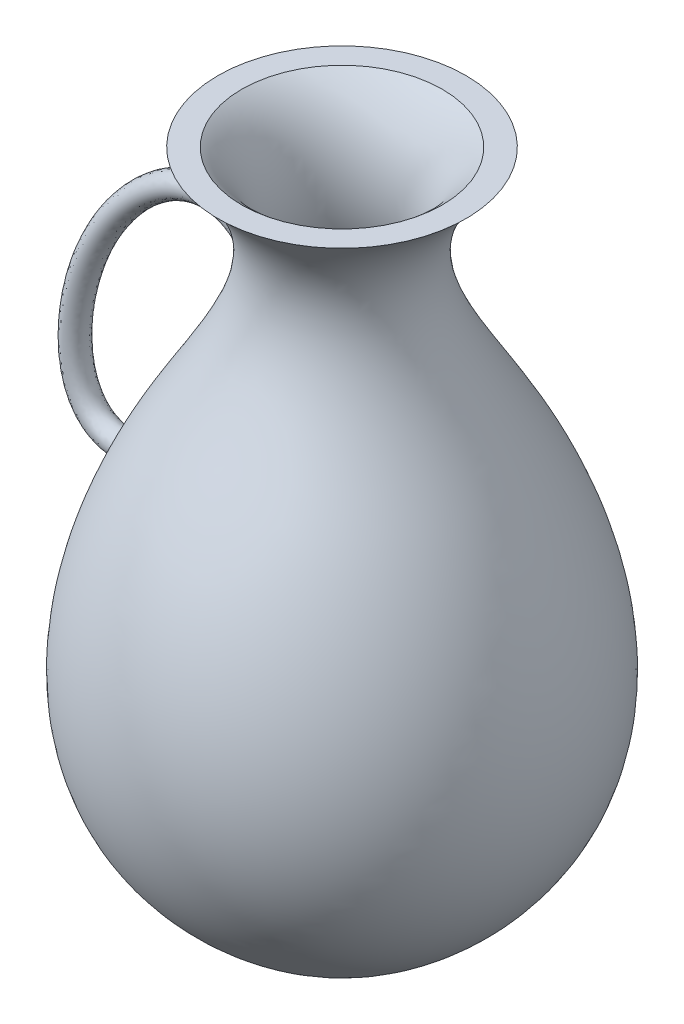
ISO-10303-21;
HEADER;
FILE_DESCRIPTION(('STEP AP214'),'2;1');
FILE_NAME('part.step','',(''),(''),'','','');
FILE_SCHEMA(('AUTOMOTIVE_DESIGN { 1 0 10303 214 1 1 1 1 }'));
ENDSEC;
DATA;
#1=APPLICATION_CONTEXT('core data for automotive mechanical design processes');
#2=APPLICATION_PROTOCOL_DEFINITION('international standard','automotive_design',2000,#1);
#3=PRODUCT_CONTEXT('',#1,'mechanical');
#4=PRODUCT('Part','Part','',(#3));
#5=PRODUCT_RELATED_PRODUCT_CATEGORY('part','',(#4));
#6=PRODUCT_DEFINITION_FORMATION('','',#4);
#7=PRODUCT_DEFINITION_CONTEXT('part definition',#1,'design');
#8=PRODUCT_DEFINITION('design','',#6,#7);
#9=PRODUCT_DEFINITION_SHAPE('','',#8);
#10=(LENGTH_UNIT() NAMED_UNIT(*) SI_UNIT(.MILLI.,.METRE.));
#11=(NAMED_UNIT(*) PLANE_ANGLE_UNIT() SI_UNIT($,.RADIAN.));
#12=(NAMED_UNIT(*) SI_UNIT($,.STERADIAN.) SOLID_ANGLE_UNIT());
#13=UNCERTAINTY_MEASURE_WITH_UNIT(LENGTH_MEASURE(1.E-05),#10,'distance_accuracy_value','');
#14=(GEOMETRIC_REPRESENTATION_CONTEXT(3) GLOBAL_UNCERTAINTY_ASSIGNED_CONTEXT((#13)) GLOBAL_UNIT_ASSIGNED_CONTEXT((#10,
#11,#12)) REPRESENTATION_CONTEXT('',''));
#15=CARTESIAN_POINT('',(0.,0.,0.));
#16=DIRECTION('',(0.,0.,1.));
#17=DIRECTION('',(1.,0.,0.));
#18=AXIS2_PLACEMENT_3D('',#15,#16,#17);
#19=CARTESIAN_POINT('',(-23.9769236165807,44.5809399823382,0.));
#20=CARTESIAN_POINT('',(-5.42195315277621,28.4200955873217,0.));
#21=CARTESIAN_POINT('',(-46.0242510550906,-16.2187224078489,0.));
#22=CARTESIAN_POINT('',(-48.5199059719437,-74.6494313286918,0.));
#23=CARTESIAN_POINT('',(0.,-89.5207910663203,0.));
#24=B_SPLINE_CURVE_WITH_KNOTS('',3,(#19,#20,#21,#22,#23),.UNSPECIFIED.,.F.,.F.,(4,1,4),(0.,
0.339764154874091,1.),.UNSPECIFIED.);
#25=CARTESIAN_POINT('',(0.,-89.5207910663203,0.));
#26=DIRECTION('',(0.,-1.,0.));
#27=AXIS1_PLACEMENT('',#25,#26);
#28=SURFACE_OF_REVOLUTION('',#24,#27);
#29=CARTESIAN_POINT('',(-15.4846586482681,21.9881871161997,0.));
#30=CARTESIAN_POINT('',(-15.4846586310552,21.9881875024989,-0.0566308280452177));
#31=CARTESIAN_POINT('',(-15.4849672611172,21.9856475511458,-0.113260997854693));
#32=CARTESIAN_POINT('',(-15.4862046613587,21.9755390671561,-0.226055823023642));
#33=CARTESIAN_POINT('',(-15.4871333657724,21.9679710677999,-0.282220527111403));
#34=CARTESIAN_POINT('',(-15.4896201849565,21.9479452229395,-0.39366319777845));
#35=CARTESIAN_POINT('',(-15.491178367651,21.9354868497412,-0.448941067994016));
#36=CARTESIAN_POINT('',(-15.4949386130992,21.9059022086931,-0.558228113817855));
#37=CARTESIAN_POINT('',(-15.4971410383539,21.888773313214,-0.612236556613374));
#38=CARTESIAN_POINT('',(-15.5047140507907,21.8310077349153,-0.771195631375085));
#39=CARTESIAN_POINT('',(-15.5110656735246,21.7838588507491,-0.873793701972682));
#40=CARTESIAN_POINT('',(-15.5265773878386,21.6747330723559,-1.07054544744039));
#41=CARTESIAN_POINT('',(-15.5357402116098,21.6127417657875,-1.16469079157891));
#42=CARTESIAN_POINT('',(-15.5522442812345,21.5074288328944,-1.30292741598176));
#43=CARTESIAN_POINT('',(-15.5585399010819,21.4683161054983,-1.35042524865876));
#44=CARTESIAN_POINT('',(-15.5720579808302,21.3868953149317,-1.44236664276826));
#45=CARTESIAN_POINT('',(-15.5792794632435,21.3445906407976,-1.486813350536));
#46=CARTESIAN_POINT('',(-15.602400181645,21.213336537084,-1.61558369809159));
#47=CARTESIAN_POINT('',(-15.6197515456031,21.1200743068922,-1.69530234497984));
#48=CARTESIAN_POINT('',(-15.6623211085149,20.9056578277834,-1.8563612730904));
#49=CARTESIAN_POINT('',(-15.6884148487752,20.7826212365171,-1.93495101338094));
#50=CARTESIAN_POINT('',(-15.7466278575065,20.5277558219982,-2.0734914048249));
#51=CARTESIAN_POINT('',(-15.7787514538054,20.3959207278413,-2.13342858577783));
#52=CARTESIAN_POINT('',(-15.8543332905705,20.1063058610454,-2.24173116171623));
#53=CARTESIAN_POINT('',(-15.8987701585459,19.9476105926655,-2.28699078163682));
#54=CARTESIAN_POINT('',(-15.9951714069707,19.6271264926429,-2.3510527353061));
#55=CARTESIAN_POINT('',(-16.047138809496,19.465336441768,-2.36984441460604));
#56=CARTESIAN_POINT('',(-16.1594119955139,19.137333527332,-2.37976474996521));
#57=CARTESIAN_POINT('',(-16.2199467459662,18.9711652155641,-2.36989733966085));
#58=CARTESIAN_POINT('',(-16.3456121399884,18.6454561785574,-2.31881688881493));
#59=CARTESIAN_POINT('',(-16.4107407096036,18.4859125135467,-2.27761791228017));
#60=CARTESIAN_POINT('',(-16.5372387225333,18.1907388012068,-2.16737118644814));
#61=CARTESIAN_POINT('',(-16.598524473127,18.0542126658153,-2.10063975237111));
#62=CARTESIAN_POINT('',(-16.7184869401965,17.7967847275552,-1.94013276263575));
#63=CARTESIAN_POINT('',(-16.7771658522437,17.6758696063833,-1.84638048313262));
#64=CARTESIAN_POINT('',(-16.8815534502158,17.467012939596,-1.64597061656276));
#65=CARTESIAN_POINT('',(-16.9279786140545,17.3768917722089,-1.5419539476044));
#66=CARTESIAN_POINT('',(-17.0126065031513,17.2158577137798,-1.31706256212995));
#67=CARTESIAN_POINT('',(-17.0508136375267,17.1449345173824,-1.19619694303089));
#68=CARTESIAN_POINT('',(-17.1136960510831,17.0297751263797,-0.952121002301007));
#69=CARTESIAN_POINT('',(-17.1392341074897,16.9838066034065,-0.829946830536704));
#70=CARTESIAN_POINT('',(-17.1797511414962,16.9113908884151,-0.578282406850921));
#71=CARTESIAN_POINT('',(-17.1947328208396,16.8849387014069,-0.448794036057802));
#72=CARTESIAN_POINT('',(-17.2128885581464,16.8529365170228,-0.191578972930642));
#73=CARTESIAN_POINT('',(-17.2164967257469,16.8466179434769,-0.0639777212258459));
#74=CARTESIAN_POINT('',(-17.2129381525049,16.8528697303324,0.190603690280205));
#75=CARTESIAN_POINT('',(-17.2057725099638,16.8654381653584,0.317583912066517));
#76=CARTESIAN_POINT('',(-17.1811809750066,16.9089276326889,0.56609121625103));
#77=CARTESIAN_POINT('',(-17.163851544402,16.9396761446286,0.687658155547459));
#78=CARTESIAN_POINT('',(-17.119949926502,17.0185779555019,0.92322420627447));
#79=CARTESIAN_POINT('',(-17.0933778598061,17.0667310273381,1.03722341642692));
#80=CARTESIAN_POINT('',(-17.0320745599174,17.179767536135,1.25582797109556));
#81=CARTESIAN_POINT('',(-16.9972592201795,17.2448241558124,1.3603199899664));
#82=CARTESIAN_POINT('',(-16.9214440664285,17.3896421194946,1.55599624889569));
#83=CARTESIAN_POINT('',(-16.8804435689232,17.4694050888444,1.64717901601871));
#84=CARTESIAN_POINT('',(-16.7926641583825,17.6447024491478,1.81748171967185));
#85=CARTESIAN_POINT('',(-16.7457277508725,17.7407105501863,1.8960317153966));
#86=CARTESIAN_POINT('',(-16.649574432133,17.9436674679995,2.03560357370403));
#87=CARTESIAN_POINT('',(-16.6003569055191,18.0506192465927,2.09662067404329));
#88=CARTESIAN_POINT('',(-16.4980963930875,18.2808467945798,2.20438218944362));
#89=CARTESIAN_POINT('',(-16.445033809258,18.4047436435224,2.24977778365198));
#90=CARTESIAN_POINT('',(-16.3406785653287,18.6589307397837,2.31996332648055));
#91=CARTESIAN_POINT('',(-16.2893866453892,18.7892236068976,2.34474475573452));
#92=CARTESIAN_POINT('',(-16.1851250555281,19.0666652448371,2.37576887395004));
#93=CARTESIAN_POINT('',(-16.1325108474612,19.2141855044415,2.37988178822115));
#94=CARTESIAN_POINT('',(-16.0327758802893,19.5098876163368,2.36486199329155));
#95=CARTESIAN_POINT('',(-15.9856573867994,19.6580697155176,2.34571973398011));
#96=CARTESIAN_POINT('',(-15.8934921143531,19.9660000711099,2.28226670567207));
#97=CARTESIAN_POINT('',(-15.8490876304141,20.1254790603436,2.23569852959258));
#98=CARTESIAN_POINT('',(-15.7683337162789,20.4368955593259,2.11681243104902));
#99=CARTESIAN_POINT('',(-15.7319923211072,20.5888254303001,2.04446900841204));
#100=CARTESIAN_POINT('',(-15.6664304468764,20.8842414562867,1.87229357219351));
#101=CARTESIAN_POINT('',(-15.6374475785367,21.0273539586041,1.77172386531045));
#102=CARTESIAN_POINT('',(-15.5876347962741,21.2931583355737,1.54490088277879));
#103=CARTESIAN_POINT('',(-15.5667877371376,21.4158928370648,1.41870247971863));
#104=CARTESIAN_POINT('',(-15.5378251492661,21.5987471947336,1.18543110372288));
#105=CARTESIAN_POINT('',(-15.5277662138425,21.6664852615925,1.08454612887964));
#106=CARTESIAN_POINT('',(-15.5109183262407,21.7847863737424,0.872936447875485));
#107=CARTESIAN_POINT('',(-15.5041251846823,21.8353713983684,0.762224564996117));
#108=CARTESIAN_POINT('',(-15.4940622447935,21.9123955949627,0.543993618011293));
#109=CARTESIAN_POINT('',(-15.4905235676073,21.9406425723435,0.437134874888648));
#110=CARTESIAN_POINT('',(-15.4869980884764,21.9690756545416,0.274463539073463));
#111=CARTESIAN_POINT('',(-15.4861200244254,21.9762305249835,0.21981896050355));
#112=CARTESIAN_POINT('',(-15.4849504191475,21.9857852049477,0.110115942211978));
#113=CARTESIAN_POINT('',(-15.4846586650029,21.9881867406317,0.0550576600195059));
#114=CARTESIAN_POINT('',(-15.4846586482681,21.9881871161997,0.));
#115=B_SPLINE_CURVE_WITH_KNOTS('',3,(#29,#30,#31,#32,#33,#34,#35,#36,#37,#38,#39,#40,#41,#42,
#43,#44,#45,#46,#47,#48,#49,#50,#51,#52,#53,#54,#55,#56,#57,#58,#59,#60,#61,#62,#63,#64,#65,#66,
#67,#68,#69,#70,#71,#72,#73,#74,#75,#76,#77,#78,#79,#80,#81,#82,#83,#84,#85,#86,#87,#88,#89,#90,
#91,#92,#93,#94,#95,#96,#97,#98,#99,#100,#101,#102,#103,#104,#105,#106,#107,#108,#109,#110,#111,
#112,#113,#114),.UNSPECIFIED.,.T.,.F.,(4,2,2,2,2,2,2,2,2,2,2,2,2,2,2,2,2,2,2,2,2,2,2,2,2,2,2,2,
2,2,2,2,2,2,2,2,2,2,2,2,2,2,4),(0.,0.169833803772745,0.3396495976529,0.509483720485779,
0.679413589613035,1.01712267816399,1.35516102969569,1.54056426368787,1.72577334405214,
2.09632448642307,2.53957752453702,2.98314992502883,3.49357922503822,4.00421393544017,
4.53280615113746,5.06116123410674,5.54995315274622,6.03832527084979,6.47171935399056,
6.90488033035395,7.30191734409671,7.69885270533125,8.08044185419732,8.46199210582153,
8.83997845863488,9.21795987960476,9.59997801870668,9.98203840376801,10.3782103751785,
10.7744898523811,11.1993851813726,11.6244560228351,12.0925414465416,12.5608191620463,
13.0744362605198,13.5885629122072,14.1176293708063,14.6455747875883,15.0099534783168,
15.3738634862652,15.7039360119797,15.8691119360109,16.0342278658093),.UNSPECIFIED.);
#116=CARTESIAN_POINT('',(-15.4846586482681,21.9881871161997,0.));
#117=VERTEX_POINT('',#116);
#118=EDGE_CURVE('E74',#117,#117,#115,.T.);
#119=ORIENTED_EDGE('',*,*,#118,.F.);
#120=EDGE_LOOP('',(#119));
#121=FACE_BOUND('',#120,.T.);
#122=CARTESIAN_POINT('',(0.,44.5809399823382,0.));
#123=DIRECTION('',(0.,-1.,0.));
#124=DIRECTION('',(0.,0.,-1.));
#125=AXIS2_PLACEMENT_3D('',#122,#123,#124);
#126=CIRCLE('',#125,23.9769236165807);
#127=CARTESIAN_POINT('',(0.,44.5809399823382,-23.9769236165807));
#128=VERTEX_POINT('',#127);
#129=EDGE_CURVE('E77',#128,#128,#126,.T.);
#130=ORIENTED_EDGE('',*,*,#129,.T.);
#131=EDGE_LOOP('',(#130));
#132=FACE_BOUND('',#131,.T.);
#133=CARTESIAN_POINT('',(0.,-89.5207910663203,0.));
#134=VERTEX_POINT('',#133);
#135=VERTEX_LOOP('',#134);
#136=FACE_BOUND('',#135,.T.);
#137=CARTESIAN_POINT('',(-37.2899792134387,-23.7287343852869,2.40450873457841));
#138=CARTESIAN_POINT('',(-37.3267072141203,-23.6793700726973,1.60300582305227));
#139=CARTESIAN_POINT('',(-37.3450712144611,-23.6546879164025,0.801502911526137));
#140=CARTESIAN_POINT('',(-37.3450712144611,-23.6546879164025,-0.801502911526134));
#141=CARTESIAN_POINT('',(-37.3267072141203,-23.6793700726973,-1.60300582305227));
#142=CARTESIAN_POINT('',(-37.2899792134387,-23.7287343852869,-2.4045087345784));
#143=B_SPLINE_CURVE_WITH_KNOTS('',3,(#137,#138,#139,#140,#141,#142),.UNSPECIFIED.,.F.,.F.,(4,2,
4),(0.,2.40627934014211,4.81255868028423),.UNSPECIFIED.);
#144=CARTESIAN_POINT('',(-37.324553449318,-23.6822648428175,1.46781991482423));
#145=VERTEX_POINT('',#144);
#146=CARTESIAN_POINT('',(-37.324553449318,-23.6822648428175,-1.46781991482425));
#147=VERTEX_POINT('',#146);
#148=EDGE_CURVE('E11',#145,#147,#143,.T.);
#149=ORIENTED_EDGE('',*,*,#148,.F.);
#150=CARTESIAN_POINT('',(-37.324553449318,-23.6822648428175,-1.46781991482425));
#151=CARTESIAN_POINT('',(-37.3368074573239,-23.7300693915853,-1.52357790230743));
#152=CARTESIAN_POINT('',(-37.3497103674309,-23.7802842589039,-1.57705726482879));
#153=CARTESIAN_POINT('',(-37.3766995131034,-23.8850179480785,-1.67923043926734));
#154=CARTESIAN_POINT('',(-37.3907850303667,-23.9395341561538,-1.72792711768295));
#155=CARTESIAN_POINT('',(-37.4345436284967,-24.1083743388203,-1.86620681581523));
#156=CARTESIAN_POINT('',(-37.4658242292105,-24.2284025102152,-1.94845417733407));
#157=CARTESIAN_POINT('',(-37.5316336341045,-24.4791867318706,-2.09174475142458));
#158=CARTESIAN_POINT('',(-37.5661554173511,-24.6099195190011,-2.15283251108086));
#159=CARTESIAN_POINT('',(-37.6376995655826,-24.8789199094511,-2.25345528416354));
#160=CARTESIAN_POINT('',(-37.674724413007,-25.017194965848,-2.29296853773085));
#161=CARTESIAN_POINT('',(-37.7534665065004,-25.3091364373777,-2.35216875340774));
#162=CARTESIAN_POINT('',(-37.7953212833789,-25.4631443025396,-2.36999795898259));
#163=CARTESIAN_POINT('',(-37.8798461832126,-25.7717544933278,-2.37944400714323));
#164=CARTESIAN_POINT('',(-37.9225164232186,-25.9263569017113,-2.37105705816984));
#165=CARTESIAN_POINT('',(-38.0086930799105,-26.2362779746183,-2.32731082081028));
#166=CARTESIAN_POINT('',(-38.052189402669,-26.3914952130642,-2.29120197196735));
#167=CARTESIAN_POINT('',(-38.1373764048592,-26.693341871101,-2.19130733680301));
#168=CARTESIAN_POINT('',(-38.1790672459042,-26.8399720597574,-2.12752403335114));
#169=CARTESIAN_POINT('',(-38.2574001147454,-27.1137491737671,-1.97627271113693));
#170=CARTESIAN_POINT('',(-38.2941787068955,-27.2414468066039,-1.889876731829));
#171=CARTESIAN_POINT('',(-38.3630125132435,-27.4792216137396,-1.69398253942996));
#172=CARTESIAN_POINT('',(-38.3950705495669,-27.58930931934,-1.58449822542107));
#173=CARTESIAN_POINT('',(-38.4502628618685,-27.7780818171513,-1.35589862416585));
#174=CARTESIAN_POINT('',(-38.4739366506348,-27.8586866379785,-1.23850077113203));
#175=CARTESIAN_POINT('',(-38.5148152917476,-27.997504912286,-0.990120580921116));
#176=CARTESIAN_POINT('',(-38.5320246760738,-28.0557340532744,-0.859147843146157));
#177=CARTESIAN_POINT('',(-38.557750531908,-28.1426495243621,-0.60061617752544));
#178=CARTESIAN_POINT('',(-38.5669273969265,-28.173582426155,-0.473875590983884));
#179=CARTESIAN_POINT('',(-38.5787045983607,-28.2132649948178,-0.216680733669161));
#180=CARTESIAN_POINT('',(-38.581307562565,-28.2220235254634,-0.0862279678615391));
#181=CARTESIAN_POINT('',(-38.5798475604531,-28.2171075582975,0.166914652490979));
#182=CARTESIAN_POINT('',(-38.5761475409685,-28.2046544988519,0.289632459036865));
#183=CARTESIAN_POINT('',(-38.5629449398844,-28.1601551208917,0.531122215167683));
#184=CARTESIAN_POINT('',(-38.5534427354924,-28.1281100760771,0.649894420731989));
#185=CARTESIAN_POINT('',(-38.5290613355951,-28.0457017476329,0.880318754068467));
#186=CARTESIAN_POINT('',(-38.5141807829853,-27.9953338406225,0.991969076421617));
#187=CARTESIAN_POINT('',(-38.4796627703841,-27.878145801705,1.20544463231601));
#188=CARTESIAN_POINT('',(-38.4600244788797,-27.8113227938959,1.3072681440647));
#189=CARTESIAN_POINT('',(-38.4156181343548,-27.6596659411153,1.50387362278354));
#190=CARTESIAN_POINT('',(-38.3906398032858,-27.5740882831112,1.59803307905693));
#191=CARTESIAN_POINT('',(-38.3371359088114,-27.3899508253879,1.7714426650222));
#192=CARTESIAN_POINT('',(-38.3086092007067,-27.2913868356942,1.85068796261056));
#193=CARTESIAN_POINT('',(-38.2464096779871,-27.0753895336356,1.99903930622971));
#194=CARTESIAN_POINT('',(-38.2125062192951,-26.957068843783,2.06675571897937));
#195=CARTESIAN_POINT('',(-38.1426306991051,-26.711743230131,2.18250729252697));
#196=CARTESIAN_POINT('',(-38.1066578242746,-26.5847348881079,2.23053465393482));
#197=CARTESIAN_POINT('',(-38.0303354774032,-26.3135448519302,2.30989910804999));
#198=CARTESIAN_POINT('',(-37.9898821445939,-26.1688426841476,2.33936148363494));
#199=CARTESIAN_POINT('',(-37.9087784671963,-25.8766317367916,2.37432674393227));
#200=CARTESIAN_POINT('',(-37.868128071183,-25.7291221915638,2.37982299553302));
#201=CARTESIAN_POINT('',(-37.7850628295748,-25.4254851838159,2.3665784371132));
#202=CARTESIAN_POINT('',(-37.7427012764791,-25.2694095180474,2.34626602422662));
#203=CARTESIAN_POINT('',(-37.6600065796816,-24.9623831767027,2.27902592996126));
#204=CARTESIAN_POINT('',(-37.6196750499642,-24.8114366090886,2.23207742421916));
#205=CARTESIAN_POINT('',(-37.5418525374263,-24.5180384237739,2.11170990360002));
#206=CARTESIAN_POINT('',(-37.5043895192584,-24.3756727627694,2.0380627072749));
#207=CARTESIAN_POINT('',(-37.4339439955159,-24.1061660582162,1.86554381796084));
#208=CARTESIAN_POINT('',(-37.4009489637689,-23.9789825748114,1.7667449796845));
#209=CARTESIAN_POINT('',(-37.3626784396356,-23.8306256931989,1.6266954556448));
#210=CARTESIAN_POINT('',(-37.3547410383763,-23.7998032328572,1.59604340369145));
#211=CARTESIAN_POINT('',(-37.3393116249731,-23.7397956818393,1.53313327010986));
#212=CARTESIAN_POINT('',(-37.3318191574504,-23.7106089188509,1.50087689486208));
#213=CARTESIAN_POINT('',(-37.3245534493179,-23.6822648428174,1.46781991482437));
#214=B_SPLINE_CURVE_WITH_KNOTS('',3,(#150,#151,#152,#153,#154,#155,#156,#157,#158,#159,#160,
#161,#162,#163,#164,#165,#166,#167,#168,#169,#170,#171,#172,#173,#174,#175,#176,#177,#178,#179,
#180,#181,#182,#183,#184,#185,#186,#187,#188,#189,#190,#191,#192,#193,#194,#195,#196,#197,#198,
#199,#200,#201,#202,#203,#204,#205,#206,#207,#208,#209,#210,#211,#212,#213),.UNSPECIFIED.,.F.,
.F.,(4,2,2,2,2,2,2,2,2,2,2,2,2,2,2,2,2,2,2,2,2,2,2,2,2,2,2,2,2,2,2,4),(0.,0.223212312674419,
0.44629001617342,0.89055772562822,1.33388435566391,1.7776572989881,2.25725025739926,
2.73691258102643,3.23002192547108,3.72308703876081,4.19604317143771,4.66871539511878,
5.09943266891917,5.52984741503882,5.92017113178835,6.31033879953349,6.67879063963688,
7.04721852876243,7.41573944731079,7.78432481901475,8.17167734081089,8.55915514740476,
8.97882943995214,9.39866981709133,9.85602324583968,10.3135032484082,10.8002237857944,
11.2873253715585,11.7786921155954,12.2686514384536,12.4011729398799,12.5335563843244),.UNSPECIFIED.);
#215=EDGE_CURVE('E54',#147,#145,#214,.T.);
#216=ORIENTED_EDGE('',*,*,#215,.F.);
#217=EDGE_LOOP('',(#149,#216));
#218=FACE_BOUND('',#217,.T.);
#219=ADVANCED_FACE('F39',(#121,#132,#136,#218),#28,.T.);
#220=CARTESIAN_POINT('',(0.,-83.6529611534615,0.));
#221=CARTESIAN_POINT('',(-18.8273509329528,-81.3060506600959,0.));
#222=CARTESIAN_POINT('',(-41.7276479140341,-53.076582227795,0.));
#223=CARTESIAN_POINT('',(-31.9513339306495,-14.4111684076801,0.));
#224=CARTESIAN_POINT('',(-19.3894394453015,6.08883171100316,0.));
#225=CARTESIAN_POINT('',(-9.69155640075355,24.0860237894318,0.));
#226=CARTESIAN_POINT('',(-12.657259419159,39.4837076276809,0.));
#227=CARTESIAN_POINT('',(-19.3913605625354,44.5809399823382,0.));
#228=B_SPLINE_CURVE_WITH_KNOTS('',3,(#220,#221,#222,#223,#224,#225,#226,#227),.UNSPECIFIED.,.F.,
.F.,(4,1,1,1,1,4),(0.,0.35527535785486,0.598241481276308,0.738765992364557,0.836368535399588,
1.),.UNSPECIFIED.);
#229=CARTESIAN_POINT('',(0.,-89.5207910663203,0.));
#230=DIRECTION('',(0.,-1.,0.));
#231=AXIS1_PLACEMENT('',#229,#230);
#232=SURFACE_OF_REVOLUTION('',#228,#231);
#233=CARTESIAN_POINT('',(0.,44.5809399823382,0.));
#234=DIRECTION('',(0.,-1.,0.));
#235=DIRECTION('',(0.,0.,-1.));
#236=AXIS2_PLACEMENT_3D('',#233,#234,#235);
#237=CIRCLE('',#236,19.3913605625354);
#238=CARTESIAN_POINT('',(0.,44.5809399823382,-19.3913605625354));
#239=VERTEX_POINT('',#238);
#240=EDGE_CURVE('E81',#239,#239,#237,.T.);
#241=ORIENTED_EDGE('',*,*,#240,.F.);
#242=EDGE_LOOP('',(#241));
#243=FACE_BOUND('',#242,.T.);
#244=CARTESIAN_POINT('',(0.,-83.6529611534615,0.));
#245=VERTEX_POINT('',#244);
#246=VERTEX_LOOP('',#245);
#247=FACE_BOUND('',#246,.T.);
#248=ADVANCED_FACE('F97',(#243,#247),#232,.T.);
#249=CARTESIAN_POINT('',(-23.9769236165807,44.5809399823382,0.));
#250=DIRECTION('',(0.,-1.,0.));
#251=DIRECTION('',(0.,0.,-1.));
#252=AXIS2_PLACEMENT_3D('',#249,#250,#251);
#253=PLANE('',#252);
#254=ORIENTED_EDGE('',*,*,#129,.F.);
#255=EDGE_LOOP('',(#254));
#256=FACE_BOUND('',#255,.T.);
#257=ORIENTED_EDGE('',*,*,#240,.T.);
#258=EDGE_LOOP('',(#257));
#259=FACE_BOUND('',#258,.T.);
#260=ADVANCED_FACE('F100',(#256,#259),#253,.F.);
#261=CARTESIAN_POINT('',(-36.2092679096254,-25.1812656864879,0.));
#262=DIRECTION('',(-0.802297294425958,-0.596924661374271,0.));
#263=DIRECTION('',(0.596924661374271,-0.802297294425958,0.));
#264=AXIS2_PLACEMENT_3D('',#261,#262,#263);
#265=PLANE('',#264);
#266=CARTESIAN_POINT('',(-36.2092679096254,-25.1812656864879,0.));
#267=DIRECTION('',(-0.802297294425958,-0.596924661374271,0.));
#268=DIRECTION('',(0.596924661374271,-0.802297294425958,0.));
#269=AXIS2_PLACEMENT_3D('',#266,#267,#268);
#270=CIRCLE('',#269,2.37599677329881);
#271=EDGE_CURVE('E72',#145,#147,#270,.T.);
#272=ORIENTED_EDGE('',*,*,#271,.F.);
#273=ORIENTED_EDGE('',*,*,#148,.T.);
#274=EDGE_LOOP('',(#272,#273));
#275=FACE_BOUND('',#274,.T.);
#276=ADVANCED_FACE('F75',(#275),#265,.F.);
#277=CARTESIAN_POINT('',(-14.1053850901401,20.3242662220505,0.));
#278=CARTESIAN_POINT('',(-15.4333271672953,22.1231137795495,0.));
#279=CARTESIAN_POINT('',(-16.9344380231658,23.5345583812764,0.));
#280=CARTESIAN_POINT('',(-20.2030183702306,25.5535630565703,0.));
#281=CARTESIAN_POINT('',(-21.966831972044,26.1523563316708,0.));
#282=CARTESIAN_POINT('',(-25.529426934172,26.5813519092787,0.));
#283=CARTESIAN_POINT('',(-27.3208972058663,26.41849647059,0.));
#284=CARTESIAN_POINT('',(-30.806116647321,25.5203978154407,0.));
#285=CARTESIAN_POINT('',(-32.5049931785019,24.7875569617488,0.));
#286=CARTESIAN_POINT('',(-37.4380615828113,21.9305664565184,0.));
#287=CARTESIAN_POINT('',(-40.5230212628504,19.1477971449802,0.));
#288=CARTESIAN_POINT('',(-45.995799098917,12.4450263691341,0.));
#289=CARTESIAN_POINT('',(-48.3777897244006,8.51957217230118,0.));
#290=CARTESIAN_POINT('',(-51.9176798979463,0.200213146339088,0.));
#291=CARTESIAN_POINT('',(-53.1026085880393,-4.14315009363386,0.));
#292=CARTESIAN_POINT('',(-54.1249163724813,-12.4828592191558,0.));
#293=CARTESIAN_POINT('',(-53.9767655102336,-16.4839515813207,0.));
#294=CARTESIAN_POINT('',(-52.3773272333543,-21.6292418901739,0.));
#295=CARTESIAN_POINT('',(-51.6071580450206,-23.2048294567356,0.));
#296=CARTESIAN_POINT('',(-49.4832912561791,-25.8800725168728,0.));
#297=CARTESIAN_POINT('',(-48.1175382800909,-26.9706705315912,0.));
#298=CARTESIAN_POINT('',(-44.8997571536976,-28.3599010466739,0.));
#299=CARTESIAN_POINT('',(-43.0724294582478,-28.6540063280546,0.));
#300=CARTESIAN_POINT('',(-39.1579691816672,-28.448568388217,0.));
#301=CARTESIAN_POINT('',(-37.0627268094746,-27.9618842041141,0.));
#302=CARTESIAN_POINT('',(-34.7909768402977,-27.0875214692703,0.));
#303=CARTESIAN_POINT('',(-14.1053850901401,20.3242662220505,4.75199354659763));
#304=CARTESIAN_POINT('',(-15.4333271672953,22.1231137795495,4.75199354659763));
#305=CARTESIAN_POINT('',(-16.9344380231658,23.5345583812764,4.75199354659763));
#306=CARTESIAN_POINT('',(-20.2030183702306,25.5535630565703,4.75199354659763));
#307=CARTESIAN_POINT('',(-21.966831972044,26.1523563316708,4.75199354659763));
#308=CARTESIAN_POINT('',(-25.529426934172,26.5813519092787,4.75199354659763));
#309=CARTESIAN_POINT('',(-27.3208972058663,26.41849647059,4.75199354659763));
#310=CARTESIAN_POINT('',(-30.806116647321,25.5203978154407,4.75199354659763));
#311=CARTESIAN_POINT('',(-32.5049931785019,24.7875569617488,4.75199354659763));
#312=CARTESIAN_POINT('',(-37.4380615828113,21.9305664565184,4.75199354659763));
#313=CARTESIAN_POINT('',(-40.5230212628504,19.1477971449802,4.75199354659763));
#314=CARTESIAN_POINT('',(-45.995799098917,12.4450263691341,4.75199354659763));
#315=CARTESIAN_POINT('',(-48.3777897244006,8.51957217230118,4.75199354659763));
#316=CARTESIAN_POINT('',(-51.9176798979463,0.200213146339088,4.75199354659763));
#317=CARTESIAN_POINT('',(-53.1026085880393,-4.14315009363386,4.75199354659763));
#318=CARTESIAN_POINT('',(-54.1249163724813,-12.4828592191558,4.75199354659763));
#319=CARTESIAN_POINT('',(-53.9767655102336,-16.4839515813207,4.75199354659763));
#320=CARTESIAN_POINT('',(-52.3773272333543,-21.6292418901739,4.75199354659763));
#321=CARTESIAN_POINT('',(-51.6071580450206,-23.2048294567356,4.75199354659763));
#322=CARTESIAN_POINT('',(-49.4832912561791,-25.8800725168728,4.75199354659763));
#323=CARTESIAN_POINT('',(-48.1175382800909,-26.9706705315912,4.75199354659763));
#324=CARTESIAN_POINT('',(-44.8997571536976,-28.3599010466739,4.75199354659763));
#325=CARTESIAN_POINT('',(-43.0724294582478,-28.6540063280546,4.75199354659763));
#326=CARTESIAN_POINT('',(-39.1579691816672,-28.448568388217,4.75199354659763));
#327=CARTESIAN_POINT('',(-37.0627268094746,-27.9618842041141,4.75199354659763));
#328=CARTESIAN_POINT('',(-34.7909768402977,-27.0875214692703,4.75199354659763));
#329=CARTESIAN_POINT('',(-17.053697401801,16.5974851472066,4.75199354659763));
#330=CARTESIAN_POINT('',(-17.9961795784492,18.0913896037545,4.75199354659763));
#331=CARTESIAN_POINT('',(-18.9843060017986,19.1980428863274,4.75199354659763));
#332=CARTESIAN_POINT('',(-21.0079673377466,20.8249921828407,4.75199354659763));
#333=CARTESIAN_POINT('',(-22.0472225022249,21.3539346839786,4.75199354659763));
#334=CARTESIAN_POINT('',(-24.2785817381817,21.9481349642922,4.75199354659763));
#335=CARTESIAN_POINT('',(-25.477853245804,22.0064321651806,4.75199354659763));
#336=CARTESIAN_POINT('',(-28.035089299327,21.6236645765725,4.75199354659763));
#337=CARTESIAN_POINT('',(-29.3879463221431,21.1802762962029,4.75199354659763));
#338=CARTESIAN_POINT('',(-33.5139710564161,19.1429141842927,4.75199354659763));
#339=CARTESIAN_POINT('',(-36.3403952790347,16.8420528636514,4.75199354659763));
#340=CARTESIAN_POINT('',(-41.437193987195,11.0202680567058,4.75199354659763));
#341=CARTESIAN_POINT('',(-43.7134037646429,7.50468291851957,4.75199354659763));
#342=CARTESIAN_POINT('',(-47.1469566629336,0.0729015392686829,4.75199354659763));
#343=CARTESIAN_POINT('',(-48.3344229416665,-3.86603330633433,4.75199354659763));
#344=CARTESIAN_POINT('',(-49.5087559947485,-11.2567061146945,4.75199354659763));
#345=CARTESIAN_POINT('',(-49.481336970183,-14.703579690895,4.75199354659763));
#346=CARTESIAN_POINT('',(-48.5964791127585,-18.7161816557495,4.75199354659763));
#347=CARTESIAN_POINT('',(-48.1683604861942,-19.8576612817818,4.75199354659763));
#348=CARTESIAN_POINT('',(-47.1021099163649,-21.7136785348334,4.75199354659763));
#349=CARTESIAN_POINT('',(-46.4758230648728,-22.4373255518852,4.75199354659763));
#350=CARTESIAN_POINT('',(-44.8633712592102,-23.5385815570775,4.75199354659763));
#351=CARTESIAN_POINT('',(-43.8526798054197,-23.9204017778748,4.75199354659763));
#352=CARTESIAN_POINT('',(-41.1970088254408,-24.1059746916319,4.75199354659763));
#353=CARTESIAN_POINT('',(-39.5602085407709,-23.8970753936107,4.75199354659763));
#354=CARTESIAN_POINT('',(-37.6275589789532,-23.2750099037054,4.75199354659763));
#355=CARTESIAN_POINT('',(-17.053697401801,16.5974851472066,0.));
#356=CARTESIAN_POINT('',(-17.9961795784492,18.0913896037545,0.));
#357=CARTESIAN_POINT('',(-18.9843060017986,19.1980428863274,0.));
#358=CARTESIAN_POINT('',(-21.0079673377466,20.8249921828407,0.));
#359=CARTESIAN_POINT('',(-22.0472225022249,21.3539346839786,0.));
#360=CARTESIAN_POINT('',(-24.2785817381817,21.9481349642922,0.));
#361=CARTESIAN_POINT('',(-25.477853245804,22.0064321651806,0.));
#362=CARTESIAN_POINT('',(-28.035089299327,21.6236645765725,0.));
#363=CARTESIAN_POINT('',(-29.3879463221431,21.1802762962029,0.));
#364=CARTESIAN_POINT('',(-33.5139710564161,19.1429141842927,0.));
#365=CARTESIAN_POINT('',(-36.3403952790347,16.8420528636514,0.));
#366=CARTESIAN_POINT('',(-41.437193987195,11.0202680567058,0.));
#367=CARTESIAN_POINT('',(-43.7134037646429,7.50468291851957,0.));
#368=CARTESIAN_POINT('',(-47.1469566629336,0.0729015392686829,0.));
#369=CARTESIAN_POINT('',(-48.3344229416665,-3.86603330633433,0.));
#370=CARTESIAN_POINT('',(-49.5087559947485,-11.2567061146945,0.));
#371=CARTESIAN_POINT('',(-49.481336970183,-14.703579690895,0.));
#372=CARTESIAN_POINT('',(-48.5964791127585,-18.7161816557495,0.));
#373=CARTESIAN_POINT('',(-48.1683604861942,-19.8576612817818,0.));
#374=CARTESIAN_POINT('',(-47.1021099163649,-21.7136785348334,0.));
#375=CARTESIAN_POINT('',(-46.4758230648728,-22.4373255518852,0.));
#376=CARTESIAN_POINT('',(-44.8633712592102,-23.5385815570775,0.));
#377=CARTESIAN_POINT('',(-43.8526798054197,-23.9204017778748,0.));
#378=CARTESIAN_POINT('',(-41.1970088254408,-24.1059746916319,0.));
#379=CARTESIAN_POINT('',(-39.5602085407709,-23.8970753936107,0.));
#380=CARTESIAN_POINT('',(-37.6275589789532,-23.2750099037054,0.));
#381=CARTESIAN_POINT('',(-17.053697401801,16.5974851472066,-4.75199354659763));
#382=CARTESIAN_POINT('',(-17.9961795784492,18.0913896037545,-4.75199354659763));
#383=CARTESIAN_POINT('',(-18.9843060017986,19.1980428863274,-4.75199354659763));
#384=CARTESIAN_POINT('',(-21.0079673377466,20.8249921828407,-4.75199354659763));
#385=CARTESIAN_POINT('',(-22.0472225022249,21.3539346839786,-4.75199354659763));
#386=CARTESIAN_POINT('',(-24.2785817381817,21.9481349642922,-4.75199354659763));
#387=CARTESIAN_POINT('',(-25.477853245804,22.0064321651806,-4.75199354659763));
#388=CARTESIAN_POINT('',(-28.035089299327,21.6236645765725,-4.75199354659763));
#389=CARTESIAN_POINT('',(-29.3879463221431,21.1802762962029,-4.75199354659763));
#390=CARTESIAN_POINT('',(-33.5139710564161,19.1429141842927,-4.75199354659763));
#391=CARTESIAN_POINT('',(-36.3403952790347,16.8420528636514,-4.75199354659763));
#392=CARTESIAN_POINT('',(-41.437193987195,11.0202680567058,-4.75199354659763));
#393=CARTESIAN_POINT('',(-43.7134037646429,7.50468291851957,-4.75199354659763));
#394=CARTESIAN_POINT('',(-47.1469566629336,0.0729015392686829,-4.75199354659763));
#395=CARTESIAN_POINT('',(-48.3344229416665,-3.86603330633433,-4.75199354659763));
#396=CARTESIAN_POINT('',(-49.5087559947485,-11.2567061146945,-4.75199354659763));
#397=CARTESIAN_POINT('',(-49.481336970183,-14.703579690895,-4.75199354659763));
#398=CARTESIAN_POINT('',(-48.5964791127585,-18.7161816557495,-4.75199354659763));
#399=CARTESIAN_POINT('',(-48.1683604861942,-19.8576612817818,-4.75199354659763));
#400=CARTESIAN_POINT('',(-47.1021099163649,-21.7136785348334,-4.75199354659763));
#401=CARTESIAN_POINT('',(-46.4758230648728,-22.4373255518852,-4.75199354659763));
#402=CARTESIAN_POINT('',(-44.8633712592102,-23.5385815570775,-4.75199354659763));
#403=CARTESIAN_POINT('',(-43.8526798054197,-23.9204017778748,-4.75199354659763));
#404=CARTESIAN_POINT('',(-41.1970088254408,-24.1059746916319,-4.75199354659763));
#405=CARTESIAN_POINT('',(-39.5602085407709,-23.8970753936107,-4.75199354659763));
#406=CARTESIAN_POINT('',(-37.6275589789532,-23.2750099037054,-4.75199354659763));
#407=CARTESIAN_POINT('',(-14.1053850901401,20.3242662220505,-4.75199354659763));
#408=CARTESIAN_POINT('',(-15.4333271672953,22.1231137795495,-4.75199354659763));
#409=CARTESIAN_POINT('',(-16.9344380231658,23.5345583812764,-4.75199354659763));
#410=CARTESIAN_POINT('',(-20.2030183702306,25.5535630565703,-4.75199354659763));
#411=CARTESIAN_POINT('',(-21.966831972044,26.1523563316708,-4.75199354659763));
#412=CARTESIAN_POINT('',(-25.529426934172,26.5813519092787,-4.75199354659763));
#413=CARTESIAN_POINT('',(-27.3208972058663,26.41849647059,-4.75199354659763));
#414=CARTESIAN_POINT('',(-30.806116647321,25.5203978154407,-4.75199354659763));
#415=CARTESIAN_POINT('',(-32.5049931785019,24.7875569617488,-4.75199354659763));
#416=CARTESIAN_POINT('',(-37.4380615828113,21.9305664565184,-4.75199354659763));
#417=CARTESIAN_POINT('',(-40.5230212628504,19.1477971449802,-4.75199354659763));
#418=CARTESIAN_POINT('',(-45.995799098917,12.4450263691341,-4.75199354659763));
#419=CARTESIAN_POINT('',(-48.3777897244006,8.51957217230118,-4.75199354659763));
#420=CARTESIAN_POINT('',(-51.9176798979463,0.200213146339088,-4.75199354659763));
#421=CARTESIAN_POINT('',(-53.1026085880393,-4.14315009363386,-4.75199354659763));
#422=CARTESIAN_POINT('',(-54.1249163724813,-12.4828592191558,-4.75199354659763));
#423=CARTESIAN_POINT('',(-53.9767655102336,-16.4839515813207,-4.75199354659763));
#424=CARTESIAN_POINT('',(-52.3773272333543,-21.6292418901739,-4.75199354659763));
#425=CARTESIAN_POINT('',(-51.6071580450206,-23.2048294567356,-4.75199354659763));
#426=CARTESIAN_POINT('',(-49.4832912561791,-25.8800725168728,-4.75199354659763));
#427=CARTESIAN_POINT('',(-48.1175382800909,-26.9706705315912,-4.75199354659763));
#428=CARTESIAN_POINT('',(-44.8997571536976,-28.3599010466739,-4.75199354659763));
#429=CARTESIAN_POINT('',(-43.0724294582478,-28.6540063280546,-4.75199354659763));
#430=CARTESIAN_POINT('',(-39.1579691816672,-28.448568388217,-4.75199354659763));
#431=CARTESIAN_POINT('',(-37.0627268094746,-27.9618842041141,-4.75199354659763));
#432=CARTESIAN_POINT('',(-34.7909768402977,-27.0875214692703,-4.75199354659763));
#433=CARTESIAN_POINT('',(-14.1053850901401,20.3242662220505,0.));
#434=CARTESIAN_POINT('',(-15.4333271672953,22.1231137795495,0.));
#435=CARTESIAN_POINT('',(-16.9344380231658,23.5345583812764,0.));
#436=CARTESIAN_POINT('',(-20.2030183702306,25.5535630565703,0.));
#437=CARTESIAN_POINT('',(-21.966831972044,26.1523563316708,0.));
#438=CARTESIAN_POINT('',(-25.529426934172,26.5813519092787,0.));
#439=CARTESIAN_POINT('',(-27.3208972058663,26.41849647059,0.));
#440=CARTESIAN_POINT('',(-30.806116647321,25.5203978154407,0.));
#441=CARTESIAN_POINT('',(-32.5049931785019,24.7875569617488,0.));
#442=CARTESIAN_POINT('',(-37.4380615828113,21.9305664565184,0.));
#443=CARTESIAN_POINT('',(-40.5230212628504,19.1477971449802,0.));
#444=CARTESIAN_POINT('',(-45.995799098917,12.4450263691341,0.));
#445=CARTESIAN_POINT('',(-48.3777897244006,8.51957217230118,0.));
#446=CARTESIAN_POINT('',(-51.9176798979463,0.200213146339088,0.));
#447=CARTESIAN_POINT('',(-53.1026085880393,-4.14315009363386,0.));
#448=CARTESIAN_POINT('',(-54.1249163724813,-12.4828592191558,0.));
#449=CARTESIAN_POINT('',(-53.9767655102336,-16.4839515813207,0.));
#450=CARTESIAN_POINT('',(-52.3773272333543,-21.6292418901739,0.));
#451=CARTESIAN_POINT('',(-51.6071580450206,-23.2048294567356,0.));
#452=CARTESIAN_POINT('',(-49.4832912561791,-25.8800725168728,0.));
#453=CARTESIAN_POINT('',(-48.1175382800909,-26.9706705315912,0.));
#454=CARTESIAN_POINT('',(-44.8997571536976,-28.3599010466739,0.));
#455=CARTESIAN_POINT('',(-43.0724294582478,-28.6540063280546,0.));
#456=CARTESIAN_POINT('',(-39.1579691816672,-28.448568388217,0.));
#457=CARTESIAN_POINT('',(-37.0627268094746,-27.9618842041141,0.));
#458=CARTESIAN_POINT('',(-34.7909768402977,-27.0875214692703,0.));
#459=(BOUNDED_SURFACE() B_SPLINE_SURFACE(3,3,((#277,#278,#279,#280,#281,#282,#283,#284,#285,
#286,#287,#288,#289,#290,#291,#292,#293,#294,#295,#296,#297,#298,#299,#300,#301,#302),(#303,
#304,#305,#306,#307,#308,#309,#310,#311,#312,#313,#314,#315,#316,#317,#318,#319,#320,#321,#322,
#323,#324,#325,#326,#327,#328),(#329,#330,#331,#332,#333,#334,#335,#336,#337,#338,#339,#340,
#341,#342,#343,#344,#345,#346,#347,#348,#349,#350,#351,#352,#353,#354),(#355,#356,#357,#358,
#359,#360,#361,#362,#363,#364,#365,#366,#367,#368,#369,#370,#371,#372,#373,#374,#375,#376,#377,
#378,#379,#380),(#381,#382,#383,#384,#385,#386,#387,#388,#389,#390,#391,#392,#393,#394,#395,
#396,#397,#398,#399,#400,#401,#402,#403,#404,#405,#406),(#407,#408,#409,#410,#411,#412,#413,
#414,#415,#416,#417,#418,#419,#420,#421,#422,#423,#424,#425,#426,#427,#428,#429,#430,#431,#432),
(#433,#434,#435,#436,#437,#438,#439,#440,#441,#442,#443,#444,#445,#446,#447,#448,#449,#450,#451,
#452,#453,#454,#455,#456,#457,#458)),.UNSPECIFIED.,.T.,.F.,.F.) B_SPLINE_SURFACE_WITH_KNOTS((4,
3,4),(4,2,2,2,2,2,2,2,2,2,2,2,4),(0.,0.5,1.),(0.,0.0633203077228341,0.126640615445668,
0.189960923168502,0.253281230891336,0.379921846337004,0.506562461782673,0.629921846337004,
0.753281230891336,0.814960923168502,0.876640615445668,0.938320307722834,1.),
.UNSPECIFIED.) GEOMETRIC_REPRESENTATION_ITEM() RATIONAL_B_SPLINE_SURFACE(((1.,1.,1.,1.,1.,1.,1.,
1.,1.,1.,1.,1.,1.,1.,1.,1.,1.,1.,1.,1.,1.,1.,1.,1.,1.,1.),(0.333333333333333,0.333333333333333,
0.333333333333333,0.333333333333333,0.333333333333333,0.333333333333333,0.333333333333333,
0.333333333333333,0.333333333333333,0.333333333333333,0.333333333333333,0.333333333333333,
0.333333333333333,0.333333333333333,0.333333333333333,0.333333333333333,0.333333333333333,
0.333333333333333,0.333333333333333,0.333333333333333,0.333333333333333,0.333333333333333,
0.333333333333333,0.333333333333333,0.333333333333333,0.333333333333333),(0.333333333333333,
0.333333333333333,0.333333333333333,0.333333333333333,0.333333333333333,0.333333333333333,
0.333333333333333,0.333333333333333,0.333333333333333,0.333333333333333,0.333333333333333,
0.333333333333333,0.333333333333333,0.333333333333333,0.333333333333333,0.333333333333333,
0.333333333333333,0.333333333333333,0.333333333333333,0.333333333333333,0.333333333333333,
0.333333333333333,0.333333333333333,0.333333333333333,0.333333333333333,0.333333333333333),(1.,
1.,1.,1.,1.,1.,1.,1.,1.,1.,1.,1.,1.,1.,1.,1.,1.,1.,1.,1.,1.,1.,1.,1.,1.,1.),(0.333333333333333,
0.333333333333333,0.333333333333333,0.333333333333333,0.333333333333333,0.333333333333333,
0.333333333333333,0.333333333333333,0.333333333333333,0.333333333333333,0.333333333333333,
0.333333333333333,0.333333333333333,0.333333333333333,0.333333333333333,0.333333333333333,
0.333333333333333,0.333333333333333,0.333333333333333,0.333333333333333,0.333333333333333,
0.333333333333333,0.333333333333333,0.333333333333333,0.333333333333333,0.333333333333333),
(0.333333333333333,0.333333333333333,0.333333333333333,0.333333333333333,0.333333333333333,
0.333333333333333,0.333333333333333,0.333333333333333,0.333333333333333,0.333333333333333,
0.333333333333333,0.333333333333333,0.333333333333333,0.333333333333333,0.333333333333333,
0.333333333333333,0.333333333333333,0.333333333333333,0.333333333333333,0.333333333333333,
0.333333333333333,0.333333333333333,0.333333333333333,0.333333333333333,0.333333333333333,
0.333333333333333),(1.,1.,1.,1.,1.,1.,1.,1.,1.,1.,1.,1.,1.,1.,1.,1.,1.,1.,1.,1.,1.,1.,1.,1.,1.,1.))) REPRESENTATION_ITEM('') SURFACE());
#460=ORIENTED_EDGE('',*,*,#118,.T.);
#461=EDGE_LOOP('',(#460));
#462=FACE_BOUND('',#461,.T.);
#463=ORIENTED_EDGE('',*,*,#271,.T.);
#464=ORIENTED_EDGE('',*,*,#215,.T.);
#465=EDGE_LOOP('',(#463,#464));
#466=FACE_BOUND('',#465,.T.);
#467=ADVANCED_FACE('F71',(#462,#466),#459,.F.);
#468=CLOSED_SHELL('',(#219,#248,#260,#276,#467));
#469=MANIFOLD_SOLID_BREP('B2',#468);
#470=ADVANCED_BREP_SHAPE_REPRESENTATION('',(#18,#469),#14);
#471=SHAPE_DEFINITION_REPRESENTATION(#9,#470);
ENDSEC;
END-ISO-10303-21;
